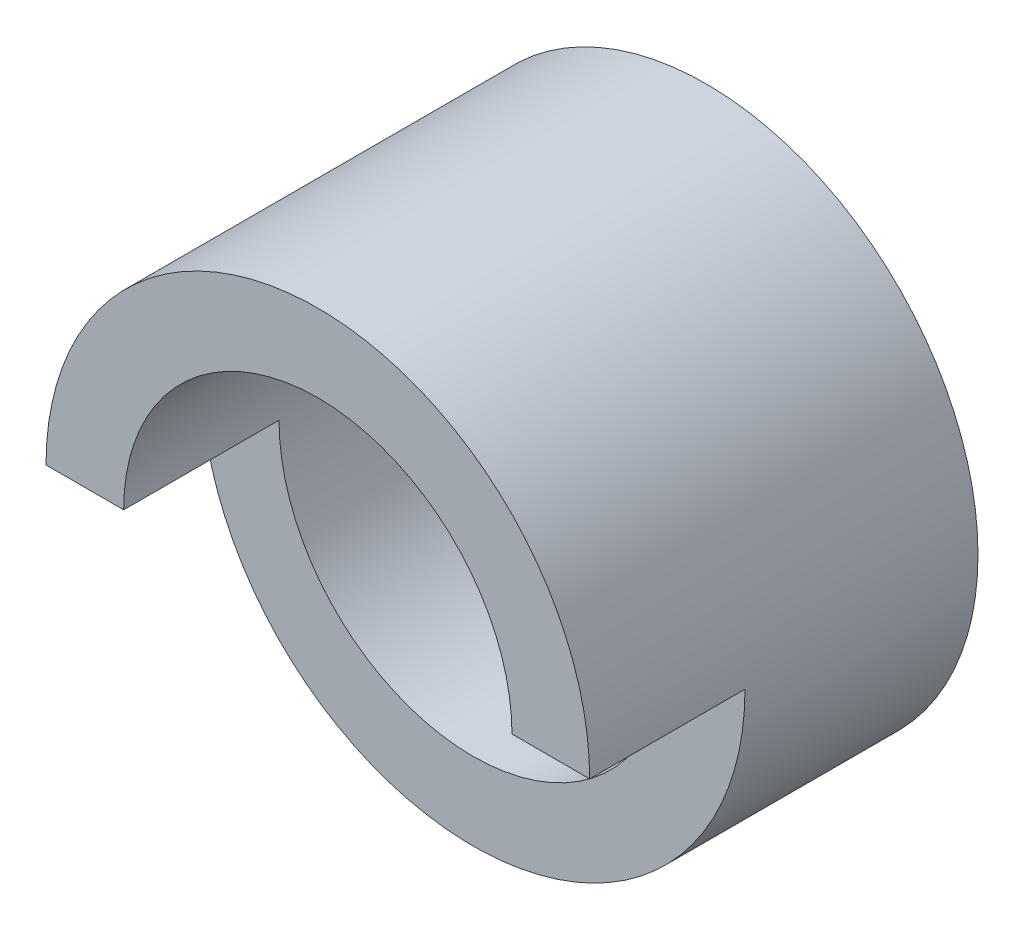
ISO-10303-21;
HEADER;
FILE_DESCRIPTION(('STEP AP214'),'2;1');
FILE_NAME('part.step','',(''),(''),'','','');
FILE_SCHEMA(('AUTOMOTIVE_DESIGN { 1 0 10303 214 1 1 1 1 }'));
ENDSEC;
DATA;
#1=APPLICATION_CONTEXT('core data for automotive mechanical design processes');
#2=APPLICATION_PROTOCOL_DEFINITION('international standard','automotive_design',2000,#1);
#3=PRODUCT_CONTEXT('',#1,'mechanical');
#4=PRODUCT('Part','Part','',(#3));
#5=PRODUCT_RELATED_PRODUCT_CATEGORY('part','',(#4));
#6=PRODUCT_DEFINITION_FORMATION('','',#4);
#7=PRODUCT_DEFINITION_CONTEXT('part definition',#1,'design');
#8=PRODUCT_DEFINITION('design','',#6,#7);
#9=PRODUCT_DEFINITION_SHAPE('','',#8);
#10=(LENGTH_UNIT() NAMED_UNIT(*) SI_UNIT(.MILLI.,.METRE.));
#11=(NAMED_UNIT(*) PLANE_ANGLE_UNIT() SI_UNIT($,.RADIAN.));
#12=(NAMED_UNIT(*) SI_UNIT($,.STERADIAN.) SOLID_ANGLE_UNIT());
#13=UNCERTAINTY_MEASURE_WITH_UNIT(LENGTH_MEASURE(1.E-05),#10,'distance_accuracy_value','');
#14=(GEOMETRIC_REPRESENTATION_CONTEXT(3) GLOBAL_UNCERTAINTY_ASSIGNED_CONTEXT((#13)) GLOBAL_UNIT_ASSIGNED_CONTEXT((#10,
#11,#12)) REPRESENTATION_CONTEXT('',''));
#15=CARTESIAN_POINT('',(0.,0.,0.));
#16=DIRECTION('',(0.,0.,1.));
#17=DIRECTION('',(1.,0.,0.));
#18=AXIS2_PLACEMENT_3D('',#15,#16,#17);
#19=CARTESIAN_POINT('',(0.,0.,10.));
#20=DIRECTION('',(0.,0.,1.));
#21=DIRECTION('',(1.,0.,0.));
#22=AXIS2_PLACEMENT_3D('',#19,#20,#21);
#23=PLANE('',#22);
#24=DIRECTION('',(1.,0.,0.));
#25=VECTOR('',#24,1.);
#26=CARTESIAN_POINT('',(-10.,0.,10.));
#27=LINE('',#26,#25);
#28=CARTESIAN_POINT('',(5.,0.,10.));
#29=VERTEX_POINT('',#28);
#30=CARTESIAN_POINT('',(7.,0.,10.));
#31=VERTEX_POINT('',#30);
#32=EDGE_CURVE('E91',#29,#31,#27,.T.);
#33=ORIENTED_EDGE('',*,*,#32,.T.);
#34=CARTESIAN_POINT('',(0.,0.,10.));
#35=DIRECTION('',(0.,0.,1.));
#36=DIRECTION('',(1.,0.,0.));
#37=AXIS2_PLACEMENT_3D('',#34,#35,#36);
#38=CIRCLE('',#37,7.);
#39=CARTESIAN_POINT('',(-7.,0.,10.));
#40=VERTEX_POINT('',#39);
#41=EDGE_CURVE('E103',#31,#40,#38,.T.);
#42=ORIENTED_EDGE('',*,*,#41,.T.);
#43=CARTESIAN_POINT('',(-5.,0.,10.));
#44=VERTEX_POINT('',#43);
#45=EDGE_CURVE('E79',#40,#44,#27,.T.);
#46=ORIENTED_EDGE('',*,*,#45,.T.);
#47=CARTESIAN_POINT('',(0.,0.,10.));
#48=DIRECTION('',(0.,0.,1.));
#49=DIRECTION('',(1.,0.,0.));
#50=AXIS2_PLACEMENT_3D('',#47,#48,#49);
#51=CIRCLE('',#50,5.);
#52=EDGE_CURVE('E97',#29,#44,#51,.T.);
#53=ORIENTED_EDGE('',*,*,#52,.F.);
#54=EDGE_LOOP('',(#33,#42,#46,#53));
#55=FACE_BOUND('',#54,.T.);
#56=ADVANCED_FACE('F33',(#55),#23,.T.);
#57=CARTESIAN_POINT('',(0.,0.,0.));
#58=DIRECTION('',(0.,0.,1.));
#59=DIRECTION('',(1.,0.,0.));
#60=AXIS2_PLACEMENT_3D('',#57,#58,#59);
#61=PLANE('',#60);
#62=CARTESIAN_POINT('',(0.,0.,0.));
#63=DIRECTION('',(0.,0.,1.));
#64=DIRECTION('',(1.,0.,0.));
#65=AXIS2_PLACEMENT_3D('',#62,#63,#64);
#66=CIRCLE('',#65,7.);
#67=CARTESIAN_POINT('',(7.,0.,0.));
#68=VERTEX_POINT('',#67);
#69=EDGE_CURVE('E100',#68,#68,#66,.T.);
#70=ORIENTED_EDGE('',*,*,#69,.F.);
#71=EDGE_LOOP('',(#70));
#72=FACE_BOUND('',#71,.T.);
#73=CARTESIAN_POINT('',(0.,0.,0.));
#74=DIRECTION('',(0.,0.,1.));
#75=DIRECTION('',(1.,0.,0.));
#76=AXIS2_PLACEMENT_3D('',#73,#74,#75);
#77=CIRCLE('',#76,5.);
#78=CARTESIAN_POINT('',(5.,0.,0.));
#79=VERTEX_POINT('',#78);
#80=EDGE_CURVE('E96',#79,#79,#77,.T.);
#81=ORIENTED_EDGE('',*,*,#80,.T.);
#82=EDGE_LOOP('',(#81));
#83=FACE_BOUND('',#82,.T.);
#84=ADVANCED_FACE('F123',(#72,#83),#61,.F.);
#85=CARTESIAN_POINT('',(0.,0.,10.));
#86=DIRECTION('',(0.,0.,-1.));
#87=DIRECTION('',(-1.,0.,0.));
#88=AXIS2_PLACEMENT_3D('',#85,#86,#87);
#89=CYLINDRICAL_SURFACE('',#88,7.);
#90=ORIENTED_EDGE('',*,*,#41,.F.);
#91=DIRECTION('',(0.,0.,-1.));
#92=VECTOR('',#91,1.);
#93=CARTESIAN_POINT('',(7.,0.,10.));
#94=LINE('',#93,#92);
#95=CARTESIAN_POINT('',(7.,0.,6.));
#96=VERTEX_POINT('',#95);
#97=EDGE_CURVE('E54',#31,#96,#94,.T.);
#98=ORIENTED_EDGE('',*,*,#97,.T.);
#99=CARTESIAN_POINT('',(0.,0.,6.));
#100=DIRECTION('',(0.,0.,-1.));
#101=DIRECTION('',(-1.,0.,0.));
#102=AXIS2_PLACEMENT_3D('',#99,#100,#101);
#103=CIRCLE('',#102,7.);
#104=CARTESIAN_POINT('',(-7.,0.,6.));
#105=VERTEX_POINT('',#104);
#106=EDGE_CURVE('E72',#96,#105,#103,.T.);
#107=ORIENTED_EDGE('',*,*,#106,.T.);
#108=DIRECTION('',(0.,0.,-1.));
#109=VECTOR('',#108,1.);
#110=CARTESIAN_POINT('',(-7.,0.,10.));
#111=LINE('',#110,#109);
#112=EDGE_CURVE('E76',#105,#40,#111,.F.);
#113=ORIENTED_EDGE('',*,*,#112,.T.);
#114=EDGE_LOOP('',(#90,#98,#107,#113));
#115=FACE_BOUND('',#114,.T.);
#116=ORIENTED_EDGE('',*,*,#69,.T.);
#117=EDGE_LOOP('',(#116));
#118=FACE_BOUND('',#117,.T.);
#119=ADVANCED_FACE('F35',(#115,#118),#89,.T.);
#120=CARTESIAN_POINT('',(0.,0.,10.));
#121=DIRECTION('',(0.,0.,-1.));
#122=DIRECTION('',(-1.,0.,0.));
#123=AXIS2_PLACEMENT_3D('',#120,#121,#122);
#124=CYLINDRICAL_SURFACE('',#123,5.);
#125=DIRECTION('',(0.,0.,-1.));
#126=VECTOR('',#125,1.);
#127=CARTESIAN_POINT('',(5.,0.,10.));
#128=LINE('',#127,#126);
#129=CARTESIAN_POINT('',(5.,0.,6.));
#130=VERTEX_POINT('',#129);
#131=EDGE_CURVE('E11',#29,#130,#128,.T.);
#132=ORIENTED_EDGE('',*,*,#131,.F.);
#133=ORIENTED_EDGE('',*,*,#52,.T.);
#134=DIRECTION('',(0.,0.,-1.));
#135=VECTOR('',#134,1.);
#136=CARTESIAN_POINT('',(-5.,0.,10.));
#137=LINE('',#136,#135);
#138=CARTESIAN_POINT('',(-5.,0.,6.));
#139=VERTEX_POINT('',#138);
#140=EDGE_CURVE('E41',#139,#44,#137,.F.);
#141=ORIENTED_EDGE('',*,*,#140,.F.);
#142=CARTESIAN_POINT('',(0.,0.,6.));
#143=DIRECTION('',(0.,0.,-1.));
#144=DIRECTION('',(-1.,0.,0.));
#145=AXIS2_PLACEMENT_3D('',#142,#143,#144);
#146=CIRCLE('',#145,5.);
#147=EDGE_CURVE('E90',#130,#139,#146,.T.);
#148=ORIENTED_EDGE('',*,*,#147,.F.);
#149=EDGE_LOOP('',(#132,#133,#141,#148));
#150=FACE_BOUND('',#149,.T.);
#151=ORIENTED_EDGE('',*,*,#80,.F.);
#152=EDGE_LOOP('',(#151));
#153=FACE_BOUND('',#152,.T.);
#154=ADVANCED_FACE('F111',(#150,#153),#124,.F.);
#155=CARTESIAN_POINT('',(-10.,0.,10.));
#156=DIRECTION('',(0.,1.,0.));
#157=DIRECTION('',(0.,0.,1.));
#158=AXIS2_PLACEMENT_3D('',#155,#156,#157);
#159=PLANE('',#158);
#160=ORIENTED_EDGE('',*,*,#32,.F.);
#161=ORIENTED_EDGE('',*,*,#131,.T.);
#162=DIRECTION('',(1.,0.,0.));
#163=VECTOR('',#162,1.);
#164=CARTESIAN_POINT('',(-10.,0.,6.));
#165=LINE('',#164,#163);
#166=EDGE_CURVE('E48',#130,#96,#165,.T.);
#167=ORIENTED_EDGE('',*,*,#166,.T.);
#168=ORIENTED_EDGE('',*,*,#97,.F.);
#169=EDGE_LOOP('',(#160,#161,#167,#168));
#170=FACE_BOUND('',#169,.T.);
#171=ADVANCED_FACE('F113',(#170),#159,.F.);
#172=EDGE_CURVE('E84',#105,#139,#165,.T.);
#173=ORIENTED_EDGE('',*,*,#172,.T.);
#174=ORIENTED_EDGE('',*,*,#140,.T.);
#175=ORIENTED_EDGE('',*,*,#45,.F.);
#176=ORIENTED_EDGE('',*,*,#112,.F.);
#177=EDGE_LOOP('',(#173,#174,#175,#176));
#178=FACE_BOUND('',#177,.T.);
#179=ADVANCED_FACE('F83',(#178),#159,.F.);
#180=CARTESIAN_POINT('',(-10.,-7.,6.));
#181=DIRECTION('',(0.,0.,-1.));
#182=DIRECTION('',(-1.,0.,0.));
#183=AXIS2_PLACEMENT_3D('',#180,#181,#182);
#184=PLANE('',#183);
#185=ORIENTED_EDGE('',*,*,#166,.F.);
#186=ORIENTED_EDGE('',*,*,#147,.T.);
#187=ORIENTED_EDGE('',*,*,#172,.F.);
#188=ORIENTED_EDGE('',*,*,#106,.F.);
#189=EDGE_LOOP('',(#185,#186,#187,#188));
#190=FACE_BOUND('',#189,.T.);
#191=ADVANCED_FACE('F88',(#190),#184,.F.);
#192=CLOSED_SHELL('',(#56,#84,#119,#154,#171,#179,#191));
#193=MANIFOLD_SOLID_BREP('B2',#192);
#194=ADVANCED_BREP_SHAPE_REPRESENTATION('',(#18,#193),#14);
#195=SHAPE_DEFINITION_REPRESENTATION(#9,#194);
ENDSEC;
END-ISO-10303-21;
